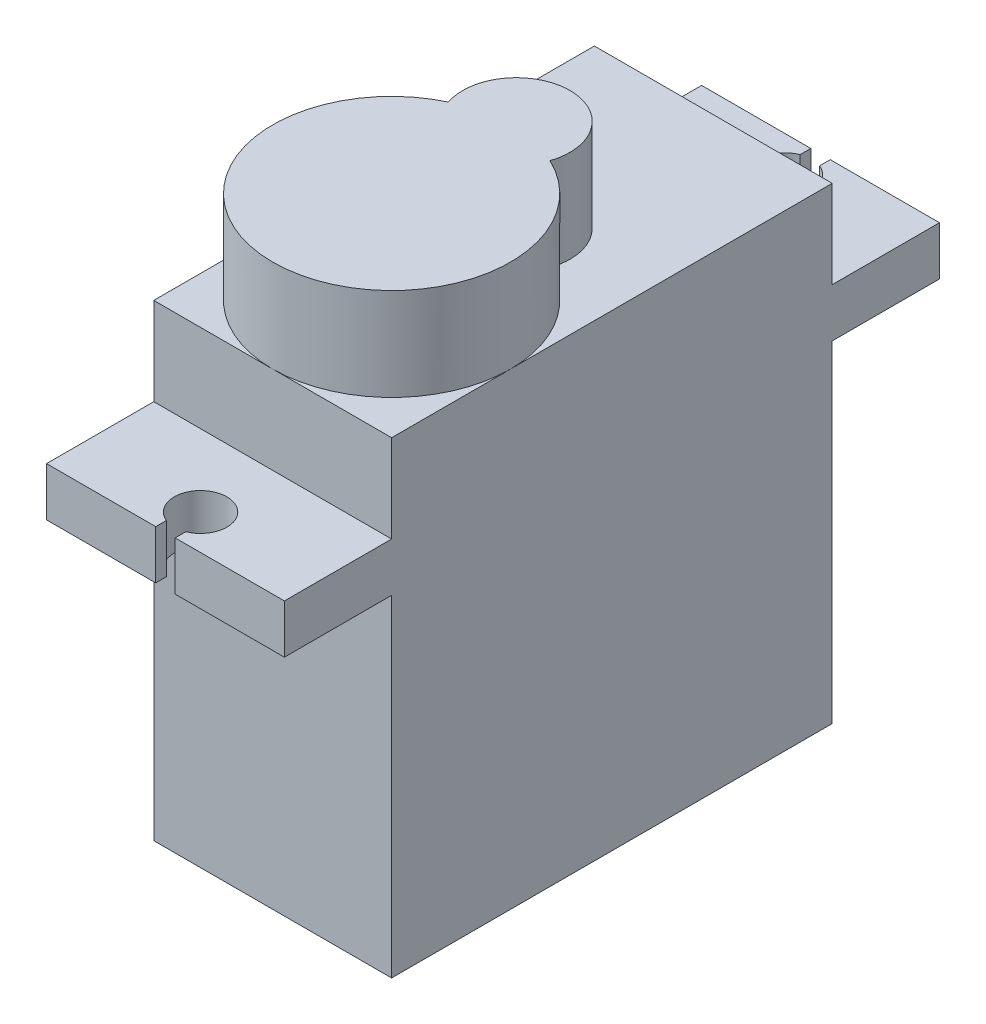
ISO-10303-21;
HEADER;
FILE_DESCRIPTION(('STEP AP214'),'2;1');
FILE_NAME('part.step','',(''),(''),'','','');
FILE_SCHEMA(('AUTOMOTIVE_DESIGN { 1 0 10303 214 1 1 1 1 }'));
ENDSEC;
DATA;
#1=APPLICATION_CONTEXT('core data for automotive mechanical design processes');
#2=APPLICATION_PROTOCOL_DEFINITION('international standard','automotive_design',2000,#1);
#3=PRODUCT_CONTEXT('',#1,'mechanical');
#4=PRODUCT('Part','Part','',(#3));
#5=PRODUCT_RELATED_PRODUCT_CATEGORY('part','',(#4));
#6=PRODUCT_DEFINITION_FORMATION('','',#4);
#7=PRODUCT_DEFINITION_CONTEXT('part definition',#1,'design');
#8=PRODUCT_DEFINITION('design','',#6,#7);
#9=PRODUCT_DEFINITION_SHAPE('','',#8);
#10=(LENGTH_UNIT() NAMED_UNIT(*) SI_UNIT(.MILLI.,.METRE.));
#11=(NAMED_UNIT(*) PLANE_ANGLE_UNIT() SI_UNIT($,.RADIAN.));
#12=(NAMED_UNIT(*) SI_UNIT($,.STERADIAN.) SOLID_ANGLE_UNIT());
#13=UNCERTAINTY_MEASURE_WITH_UNIT(LENGTH_MEASURE(1.E-05),#10,'distance_accuracy_value','');
#14=(GEOMETRIC_REPRESENTATION_CONTEXT(3) GLOBAL_UNCERTAINTY_ASSIGNED_CONTEXT((#13)) GLOBAL_UNIT_ASSIGNED_CONTEXT((#10,
#11,#12)) REPRESENTATION_CONTEXT('',''));
#15=CARTESIAN_POINT('',(0.,0.,0.));
#16=DIRECTION('',(0.,0.,1.));
#17=DIRECTION('',(1.,0.,0.));
#18=AXIS2_PLACEMENT_3D('',#15,#16,#17);
#19=CARTESIAN_POINT('',(0.,24.,0.));
#20=DIRECTION('',(0.,-1.,0.));
#21=DIRECTION('',(0.,0.,-1.));
#22=AXIS2_PLACEMENT_3D('',#19,#20,#21);
#23=PLANE('',#22);
#24=CARTESIAN_POINT('',(6.1,24.,-12.5));
#25=DIRECTION('',(0.,1.,0.));
#26=DIRECTION('',(0.,0.,-1.));
#27=AXIS2_PLACEMENT_3D('',#24,#25,#26);
#28=CIRCLE('',#27,2.75);
#29=CARTESIAN_POINT('',(8.70411537628527,24.,-11.6162109375));
#30=VERTEX_POINT('',#29);
#31=CARTESIAN_POINT('',(3.49588462371473,24.,-11.6162109375));
#32=VERTEX_POINT('',#31);
#33=EDGE_CURVE('E221',#30,#32,#28,.T.);
#34=ORIENTED_EDGE('',*,*,#33,.F.);
#35=CARTESIAN_POINT('',(6.1,24.,-6.1));
#36=DIRECTION('',(0.,1.,0.));
#37=DIRECTION('',(0.,0.,-1.));
#38=AXIS2_PLACEMENT_3D('',#35,#36,#37);
#39=CIRCLE('',#38,6.1);
#40=CARTESIAN_POINT('',(12.2,24.,-6.1));
#41=VERTEX_POINT('',#40);
#42=EDGE_CURVE('E67',#41,#30,#39,.T.);
#43=ORIENTED_EDGE('',*,*,#42,.F.);
#44=DIRECTION('',(0.,0.,-1.));
#45=VECTOR('',#44,1.);
#46=CARTESIAN_POINT('',(12.2,24.,0.));
#47=LINE('',#46,#45);
#48=CARTESIAN_POINT('',(12.2,24.,-22.6));
#49=VERTEX_POINT('',#48);
#50=EDGE_CURVE('E393',#41,#49,#47,.T.);
#51=ORIENTED_EDGE('',*,*,#50,.T.);
#52=DIRECTION('',(-1.,0.,0.));
#53=VECTOR('',#52,1.);
#54=CARTESIAN_POINT('',(0.,24.,-22.6));
#55=LINE('',#54,#53);
#56=CARTESIAN_POINT('',(0.,24.,-22.6));
#57=VERTEX_POINT('',#56);
#58=EDGE_CURVE('E398',#49,#57,#55,.T.);
#59=ORIENTED_EDGE('',*,*,#58,.T.);
#60=DIRECTION('',(0.,0.,1.));
#61=VECTOR('',#60,1.);
#62=CARTESIAN_POINT('',(0.,24.,0.));
#63=LINE('',#62,#61);
#64=CARTESIAN_POINT('',(0.,24.,-6.1));
#65=VERTEX_POINT('',#64);
#66=EDGE_CURVE('E384',#57,#65,#63,.T.);
#67=ORIENTED_EDGE('',*,*,#66,.T.);
#68=EDGE_CURVE('E55',#32,#65,#39,.T.);
#69=ORIENTED_EDGE('',*,*,#68,.F.);
#70=EDGE_LOOP('',(#34,#43,#51,#59,#67,#69));
#71=FACE_BOUND('',#70,.T.);
#72=ADVANCED_FACE('F43',(#71),#23,.F.);
#73=CARTESIAN_POINT('',(6.1,24.,0.));
#74=VERTEX_POINT('',#73);
#75=EDGE_CURVE('E11',#65,#74,#39,.T.);
#76=ORIENTED_EDGE('',*,*,#75,.F.);
#77=CARTESIAN_POINT('',(0.,24.,0.));
#78=VERTEX_POINT('',#77);
#79=EDGE_CURVE('E388',#65,#78,#63,.T.);
#80=ORIENTED_EDGE('',*,*,#79,.T.);
#81=DIRECTION('',(1.,0.,0.));
#82=VECTOR('',#81,1.);
#83=CARTESIAN_POINT('',(0.,24.,0.));
#84=LINE('',#83,#82);
#85=EDGE_CURVE('E389',#78,#74,#84,.T.);
#86=ORIENTED_EDGE('',*,*,#85,.T.);
#87=EDGE_LOOP('',(#76,#80,#86));
#88=FACE_BOUND('',#87,.T.);
#89=ADVANCED_FACE('F460',(#88),#23,.F.);
#90=CARTESIAN_POINT('',(0.,24.,0.));
#91=DIRECTION('',(0.,0.,-1.));
#92=DIRECTION('',(-1.,0.,0.));
#93=AXIS2_PLACEMENT_3D('',#90,#91,#92);
#94=PLANE('',#93);
#95=DIRECTION('',(1.,0.,0.));
#96=VECTOR('',#95,1.);
#97=CARTESIAN_POINT('',(0.,17.,0.));
#98=LINE('',#97,#96);
#99=CARTESIAN_POINT('',(0.,17.,0.));
#100=VERTEX_POINT('',#99);
#101=CARTESIAN_POINT('',(12.2,17.,0.));
#102=VERTEX_POINT('',#101);
#103=EDGE_CURVE('E255',#100,#102,#98,.T.);
#104=ORIENTED_EDGE('',*,*,#103,.F.);
#105=DIRECTION('',(0.,-1.,0.));
#106=VECTOR('',#105,1.);
#107=CARTESIAN_POINT('',(0.,24.,0.));
#108=LINE('',#107,#106);
#109=CARTESIAN_POINT('',(0.,0.,0.));
#110=VERTEX_POINT('',#109);
#111=EDGE_CURVE('E429',#100,#110,#108,.T.);
#112=ORIENTED_EDGE('',*,*,#111,.T.);
#113=DIRECTION('',(1.,0.,0.));
#114=VECTOR('',#113,1.);
#115=CARTESIAN_POINT('',(0.,0.,0.));
#116=LINE('',#115,#114);
#117=CARTESIAN_POINT('',(12.2,0.,0.));
#118=VERTEX_POINT('',#117);
#119=EDGE_CURVE('E405',#110,#118,#116,.T.);
#120=ORIENTED_EDGE('',*,*,#119,.T.);
#121=DIRECTION('',(0.,-1.,0.));
#122=VECTOR('',#121,1.);
#123=CARTESIAN_POINT('',(12.2,24.,0.));
#124=LINE('',#123,#122);
#125=EDGE_CURVE('E425',#102,#118,#124,.T.);
#126=ORIENTED_EDGE('',*,*,#125,.F.);
#127=EDGE_LOOP('',(#104,#112,#120,#126));
#128=FACE_BOUND('',#127,.T.);
#129=ADVANCED_FACE('F444',(#128),#94,.F.);
#130=CARTESIAN_POINT('',(0.,24.,-22.6));
#131=DIRECTION('',(0.,0.,1.));
#132=DIRECTION('',(1.,0.,0.));
#133=AXIS2_PLACEMENT_3D('',#130,#131,#132);
#134=PLANE('',#133);
#135=DIRECTION('',(1.,0.,0.));
#136=VECTOR('',#135,1.);
#137=CARTESIAN_POINT('',(0.,19.5,-22.6));
#138=LINE('',#137,#136);
#139=CARTESIAN_POINT('',(0.,19.5,-22.6));
#140=VERTEX_POINT('',#139);
#141=CARTESIAN_POINT('',(12.2,19.5,-22.6));
#142=VERTEX_POINT('',#141);
#143=EDGE_CURVE('E339',#140,#142,#138,.T.);
#144=ORIENTED_EDGE('',*,*,#143,.F.);
#145=DIRECTION('',(0.,-1.,0.));
#146=VECTOR('',#145,1.);
#147=CARTESIAN_POINT('',(0.,24.,-22.6));
#148=LINE('',#147,#146);
#149=EDGE_CURVE('E417',#57,#140,#148,.T.);
#150=ORIENTED_EDGE('',*,*,#149,.F.);
#151=ORIENTED_EDGE('',*,*,#58,.F.);
#152=DIRECTION('',(0.,-1.,0.));
#153=VECTOR('',#152,1.);
#154=CARTESIAN_POINT('',(12.2,24.,-22.6));
#155=LINE('',#154,#153);
#156=EDGE_CURVE('E422',#49,#142,#155,.T.);
#157=ORIENTED_EDGE('',*,*,#156,.T.);
#158=EDGE_LOOP('',(#144,#150,#151,#157));
#159=FACE_BOUND('',#158,.T.);
#160=ADVANCED_FACE('F483',(#159),#134,.F.);
#161=CARTESIAN_POINT('',(0.,24.,0.));
#162=DIRECTION('',(1.,0.,0.));
#163=DIRECTION('',(0.,0.,-1.));
#164=AXIS2_PLACEMENT_3D('',#161,#162,#163);
#165=PLANE('',#164);
#166=DIRECTION('',(0.,0.,1.));
#167=VECTOR('',#166,1.);
#168=CARTESIAN_POINT('',(0.,0.,0.));
#169=LINE('',#168,#167);
#170=CARTESIAN_POINT('',(0.,0.,-22.6));
#171=VERTEX_POINT('',#170);
#172=EDGE_CURVE('E369',#171,#110,#169,.T.);
#173=ORIENTED_EDGE('',*,*,#172,.T.);
#174=ORIENTED_EDGE('',*,*,#111,.F.);
#175=DIRECTION('',(0.,0.,-1.));
#176=VECTOR('',#175,1.);
#177=CARTESIAN_POINT('',(0.,17.,0.));
#178=LINE('',#177,#176);
#179=CARTESIAN_POINT('',(0.,17.,5.5));
#180=VERTEX_POINT('',#179);
#181=EDGE_CURVE('E232',#180,#100,#178,.T.);
#182=ORIENTED_EDGE('',*,*,#181,.F.);
#183=DIRECTION('',(0.,1.,0.));
#184=VECTOR('',#183,1.);
#185=CARTESIAN_POINT('',(0.,17.,5.5));
#186=LINE('',#185,#184);
#187=CARTESIAN_POINT('',(0.,19.5,5.5));
#188=VERTEX_POINT('',#187);
#189=EDGE_CURVE('E258',#180,#188,#186,.T.);
#190=ORIENTED_EDGE('',*,*,#189,.T.);
#191=DIRECTION('',(0.,0.,-1.));
#192=VECTOR('',#191,1.);
#193=CARTESIAN_POINT('',(0.,19.5,0.));
#194=LINE('',#193,#192);
#195=CARTESIAN_POINT('',(0.,19.5,0.));
#196=VERTEX_POINT('',#195);
#197=EDGE_CURVE('E223',#188,#196,#194,.T.);
#198=ORIENTED_EDGE('',*,*,#197,.T.);
#199=EDGE_CURVE('E47',#78,#196,#108,.T.);
#200=ORIENTED_EDGE('',*,*,#199,.F.);
#201=ORIENTED_EDGE('',*,*,#79,.F.);
#202=ORIENTED_EDGE('',*,*,#66,.F.);
#203=ORIENTED_EDGE('',*,*,#149,.T.);
#204=DIRECTION('',(0.,0.,1.));
#205=VECTOR('',#204,1.);
#206=CARTESIAN_POINT('',(0.,19.5,-22.6));
#207=LINE('',#206,#205);
#208=CARTESIAN_POINT('',(0.,19.5,-28.1));
#209=VERTEX_POINT('',#208);
#210=EDGE_CURVE('E283',#209,#140,#207,.T.);
#211=ORIENTED_EDGE('',*,*,#210,.F.);
#212=DIRECTION('',(0.,1.,0.));
#213=VECTOR('',#212,1.);
#214=CARTESIAN_POINT('',(0.,17.,-28.1));
#215=LINE('',#214,#213);
#216=CARTESIAN_POINT('',(0.,17.,-28.1));
#217=VERTEX_POINT('',#216);
#218=EDGE_CURVE('E366',#217,#209,#215,.T.);
#219=ORIENTED_EDGE('',*,*,#218,.F.);
#220=DIRECTION('',(0.,0.,1.));
#221=VECTOR('',#220,1.);
#222=CARTESIAN_POINT('',(0.,17.,-22.6));
#223=LINE('',#222,#221);
#224=CARTESIAN_POINT('',(0.,17.,-22.6));
#225=VERTEX_POINT('',#224);
#226=EDGE_CURVE('E303',#217,#225,#223,.T.);
#227=ORIENTED_EDGE('',*,*,#226,.T.);
#228=EDGE_CURVE('E401',#225,#171,#148,.T.);
#229=ORIENTED_EDGE('',*,*,#228,.T.);
#230=EDGE_LOOP('',(#173,#174,#182,#190,#198,#200,#201,#202,#203,#211,#219,#227,#229));
#231=FACE_BOUND('',#230,.T.);
#232=ADVANCED_FACE('F45',(#231),#165,.F.);
#233=ORIENTED_EDGE('',*,*,#199,.T.);
#234=DIRECTION('',(1.,0.,0.));
#235=VECTOR('',#234,1.);
#236=CARTESIAN_POINT('',(0.,19.5,0.));
#237=LINE('',#236,#235);
#238=CARTESIAN_POINT('',(12.2,19.5,0.));
#239=VERTEX_POINT('',#238);
#240=EDGE_CURVE('E237',#196,#239,#237,.T.);
#241=ORIENTED_EDGE('',*,*,#240,.T.);
#242=CARTESIAN_POINT('',(12.2,24.,0.));
#243=VERTEX_POINT('',#242);
#244=EDGE_CURVE('E426',#243,#239,#124,.T.);
#245=ORIENTED_EDGE('',*,*,#244,.F.);
#246=EDGE_CURVE('E387',#74,#243,#84,.T.);
#247=ORIENTED_EDGE('',*,*,#246,.F.);
#248=ORIENTED_EDGE('',*,*,#85,.F.);
#249=EDGE_LOOP('',(#233,#241,#245,#247,#248));
#250=FACE_BOUND('',#249,.T.);
#251=ADVANCED_FACE('F466',(#250),#94,.F.);
#252=CARTESIAN_POINT('',(12.2,24.,0.));
#253=DIRECTION('',(-1.,0.,0.));
#254=DIRECTION('',(0.,0.,1.));
#255=AXIS2_PLACEMENT_3D('',#252,#253,#254);
#256=PLANE('',#255);
#257=DIRECTION('',(0.,0.,-1.));
#258=VECTOR('',#257,1.);
#259=CARTESIAN_POINT('',(12.2,0.,0.));
#260=LINE('',#259,#258);
#261=CARTESIAN_POINT('',(12.2,0.,-22.6));
#262=VERTEX_POINT('',#261);
#263=EDGE_CURVE('E409',#118,#262,#260,.T.);
#264=ORIENTED_EDGE('',*,*,#263,.T.);
#265=CARTESIAN_POINT('',(12.2,17.,-22.6));
#266=VERTEX_POINT('',#265);
#267=EDGE_CURVE('E421',#266,#262,#155,.T.);
#268=ORIENTED_EDGE('',*,*,#267,.F.);
#269=DIRECTION('',(0.,0.,-1.));
#270=VECTOR('',#269,1.);
#271=CARTESIAN_POINT('',(12.2,17.,-22.6));
#272=LINE('',#271,#270);
#273=CARTESIAN_POINT('',(12.2,17.,-28.1));
#274=VERTEX_POINT('',#273);
#275=EDGE_CURVE('E312',#266,#274,#272,.T.);
#276=ORIENTED_EDGE('',*,*,#275,.T.);
#277=DIRECTION('',(0.,1.,0.));
#278=VECTOR('',#277,1.);
#279=CARTESIAN_POINT('',(12.2,17.,-28.1));
#280=LINE('',#279,#278);
#281=CARTESIAN_POINT('',(12.2,19.5,-28.1));
#282=VERTEX_POINT('',#281);
#283=EDGE_CURVE('E336',#274,#282,#280,.T.);
#284=ORIENTED_EDGE('',*,*,#283,.T.);
#285=DIRECTION('',(0.,0.,-1.));
#286=VECTOR('',#285,1.);
#287=CARTESIAN_POINT('',(12.2,19.5,-22.6));
#288=LINE('',#287,#286);
#289=EDGE_CURVE('E343',#142,#282,#288,.T.);
#290=ORIENTED_EDGE('',*,*,#289,.F.);
#291=ORIENTED_EDGE('',*,*,#156,.F.);
#292=ORIENTED_EDGE('',*,*,#50,.F.);
#293=EDGE_CURVE('E394',#243,#41,#47,.T.);
#294=ORIENTED_EDGE('',*,*,#293,.F.);
#295=ORIENTED_EDGE('',*,*,#244,.T.);
#296=DIRECTION('',(0.,0.,1.));
#297=VECTOR('',#296,1.);
#298=CARTESIAN_POINT('',(12.2,19.5,0.));
#299=LINE('',#298,#297);
#300=CARTESIAN_POINT('',(12.2,19.5,5.5));
#301=VERTEX_POINT('',#300);
#302=EDGE_CURVE('E274',#239,#301,#299,.T.);
#303=ORIENTED_EDGE('',*,*,#302,.T.);
#304=DIRECTION('',(0.,1.,0.));
#305=VECTOR('',#304,1.);
#306=CARTESIAN_POINT('',(12.2,17.,5.5));
#307=LINE('',#306,#305);
#308=CARTESIAN_POINT('',(12.2,17.,5.5));
#309=VERTEX_POINT('',#308);
#310=EDGE_CURVE('E279',#309,#301,#307,.T.);
#311=ORIENTED_EDGE('',*,*,#310,.F.);
#312=DIRECTION('',(0.,0.,1.));
#313=VECTOR('',#312,1.);
#314=CARTESIAN_POINT('',(12.2,17.,0.));
#315=LINE('',#314,#313);
#316=EDGE_CURVE('E252',#102,#309,#315,.T.);
#317=ORIENTED_EDGE('',*,*,#316,.F.);
#318=ORIENTED_EDGE('',*,*,#125,.T.);
#319=EDGE_LOOP('',(#264,#268,#276,#284,#290,#291,#292,#294,#295,#303,#311,#317,#318));
#320=FACE_BOUND('',#319,.T.);
#321=ADVANCED_FACE('F437',(#320),#256,.F.);
#322=ORIENTED_EDGE('',*,*,#228,.F.);
#323=DIRECTION('',(1.,0.,0.));
#324=VECTOR('',#323,1.);
#325=CARTESIAN_POINT('',(0.,17.,-22.6));
#326=LINE('',#325,#324);
#327=EDGE_CURVE('E307',#225,#266,#326,.T.);
#328=ORIENTED_EDGE('',*,*,#327,.T.);
#329=ORIENTED_EDGE('',*,*,#267,.T.);
#330=DIRECTION('',(-1.,0.,0.));
#331=VECTOR('',#330,1.);
#332=CARTESIAN_POINT('',(0.,0.,-22.6));
#333=LINE('',#332,#331);
#334=EDGE_CURVE('E413',#262,#171,#333,.T.);
#335=ORIENTED_EDGE('',*,*,#334,.T.);
#336=EDGE_LOOP('',(#322,#328,#329,#335));
#337=FACE_BOUND('',#336,.T.);
#338=ADVANCED_FACE('F451',(#337),#134,.F.);
#339=EDGE_CURVE('E53',#74,#41,#39,.T.);
#340=ORIENTED_EDGE('',*,*,#339,.F.);
#341=ORIENTED_EDGE('',*,*,#246,.T.);
#342=ORIENTED_EDGE('',*,*,#293,.T.);
#343=EDGE_LOOP('',(#340,#341,#342));
#344=FACE_BOUND('',#343,.T.);
#345=ADVANCED_FACE('F477',(#344),#23,.F.);
#346=CARTESIAN_POINT('',(0.,0.,0.));
#347=DIRECTION('',(0.,-1.,0.));
#348=DIRECTION('',(0.,0.,-1.));
#349=AXIS2_PLACEMENT_3D('',#346,#347,#348);
#350=PLANE('',#349);
#351=ORIENTED_EDGE('',*,*,#172,.F.);
#352=ORIENTED_EDGE('',*,*,#334,.F.);
#353=ORIENTED_EDGE('',*,*,#263,.F.);
#354=ORIENTED_EDGE('',*,*,#119,.F.);
#355=EDGE_LOOP('',(#351,#352,#353,#354));
#356=FACE_BOUND('',#355,.T.);
#357=ADVANCED_FACE('F448',(#356),#350,.T.);
#358=CARTESIAN_POINT('',(0.,17.,-28.1));
#359=DIRECTION('',(0.,0.,-1.));
#360=DIRECTION('',(-1.,0.,0.));
#361=AXIS2_PLACEMENT_3D('',#358,#359,#360);
#362=PLANE('',#361);
#363=DIRECTION('',(-1.,0.,0.));
#364=VECTOR('',#363,1.);
#365=CARTESIAN_POINT('',(0.,19.5,-28.1));
#366=LINE('',#365,#364);
#367=CARTESIAN_POINT('',(5.6,19.5,-28.1));
#368=VERTEX_POINT('',#367);
#369=EDGE_CURVE('E308',#368,#209,#366,.T.);
#370=ORIENTED_EDGE('',*,*,#369,.F.);
#371=DIRECTION('',(0.,1.,0.));
#372=VECTOR('',#371,1.);
#373=CARTESIAN_POINT('',(5.6,17.,-28.1));
#374=LINE('',#373,#372);
#375=CARTESIAN_POINT('',(5.6,17.,-28.1));
#376=VERTEX_POINT('',#375);
#377=EDGE_CURVE('E370',#376,#368,#374,.T.);
#378=ORIENTED_EDGE('',*,*,#377,.F.);
#379=DIRECTION('',(-1.,0.,0.));
#380=VECTOR('',#379,1.);
#381=CARTESIAN_POINT('',(0.,17.,-28.1));
#382=LINE('',#381,#380);
#383=EDGE_CURVE('E332',#376,#217,#382,.T.);
#384=ORIENTED_EDGE('',*,*,#383,.T.);
#385=ORIENTED_EDGE('',*,*,#218,.T.);
#386=EDGE_LOOP('',(#370,#378,#384,#385));
#387=FACE_BOUND('',#386,.T.);
#388=ADVANCED_FACE('F491',(#387),#362,.T.);
#389=CARTESIAN_POINT('',(5.6,17.,-27.5539936203984));
#390=DIRECTION('',(1.,0.,0.));
#391=DIRECTION('',(0.,0.,-1.));
#392=AXIS2_PLACEMENT_3D('',#389,#390,#391);
#393=PLANE('',#392);
#394=DIRECTION('',(0.,0.,-1.));
#395=VECTOR('',#394,1.);
#396=CARTESIAN_POINT('',(5.6,19.5,-27.5539936203984));
#397=LINE('',#396,#395);
#398=CARTESIAN_POINT('',(5.6,19.5,-27.5539936203984));
#399=VERTEX_POINT('',#398);
#400=EDGE_CURVE('E359',#399,#368,#397,.T.);
#401=ORIENTED_EDGE('',*,*,#400,.F.);
#402=DIRECTION('',(0.,1.,0.));
#403=VECTOR('',#402,1.);
#404=CARTESIAN_POINT('',(5.6,17.,-27.5539936203984));
#405=LINE('',#404,#403);
#406=CARTESIAN_POINT('',(5.6,17.,-27.5539936203984));
#407=VERTEX_POINT('',#406);
#408=EDGE_CURVE('E373',#407,#399,#405,.T.);
#409=ORIENTED_EDGE('',*,*,#408,.F.);
#410=DIRECTION('',(0.,0.,-1.));
#411=VECTOR('',#410,1.);
#412=CARTESIAN_POINT('',(5.6,17.,-27.5539936203984));
#413=LINE('',#412,#411);
#414=EDGE_CURVE('E328',#407,#376,#413,.T.);
#415=ORIENTED_EDGE('',*,*,#414,.T.);
#416=ORIENTED_EDGE('',*,*,#377,.T.);
#417=EDGE_LOOP('',(#401,#409,#415,#416));
#418=FACE_BOUND('',#417,.T.);
#419=ADVANCED_FACE('F719',(#418),#393,.T.);
#420=CARTESIAN_POINT('',(6.1,17.,-26.3));
#421=DIRECTION('',(0.,1.,0.));
#422=DIRECTION('',(0.,0.,1.));
#423=AXIS2_PLACEMENT_3D('',#420,#421,#422);
#424=CYLINDRICAL_SURFACE('',#423,1.35);
#425=CARTESIAN_POINT('',(6.1,19.5,-26.3));
#426=DIRECTION('',(0.,-1.,0.));
#427=DIRECTION('',(0.,0.,1.));
#428=AXIS2_PLACEMENT_3D('',#425,#426,#427);
#429=CIRCLE('',#428,1.35);
#430=CARTESIAN_POINT('',(6.6,19.5,-27.5539936203984));
#431=VERTEX_POINT('',#430);
#432=EDGE_CURVE('E355',#431,#399,#429,.T.);
#433=ORIENTED_EDGE('',*,*,#432,.F.);
#434=DIRECTION('',(0.,1.,0.));
#435=VECTOR('',#434,1.);
#436=CARTESIAN_POINT('',(6.6,17.,-27.5539936203984));
#437=LINE('',#436,#435);
#438=CARTESIAN_POINT('',(6.6,17.,-27.5539936203984));
#439=VERTEX_POINT('',#438);
#440=EDGE_CURVE('E376',#439,#431,#437,.T.);
#441=ORIENTED_EDGE('',*,*,#440,.F.);
#442=CARTESIAN_POINT('',(6.1,17.,-26.3));
#443=DIRECTION('',(0.,-1.,0.));
#444=DIRECTION('',(0.,0.,1.));
#445=AXIS2_PLACEMENT_3D('',#442,#443,#444);
#446=CIRCLE('',#445,1.35);
#447=EDGE_CURVE('E324',#439,#407,#446,.T.);
#448=ORIENTED_EDGE('',*,*,#447,.T.);
#449=ORIENTED_EDGE('',*,*,#408,.T.);
#450=EDGE_LOOP('',(#433,#441,#448,#449));
#451=FACE_BOUND('',#450,.T.);
#452=ADVANCED_FACE('F709',(#451),#424,.F.);
#453=CARTESIAN_POINT('',(6.6,17.,-27.5539936203984));
#454=DIRECTION('',(-1.,0.,0.));
#455=DIRECTION('',(0.,0.,1.));
#456=AXIS2_PLACEMENT_3D('',#453,#454,#455);
#457=PLANE('',#456);
#458=DIRECTION('',(0.,0.,1.));
#459=VECTOR('',#458,1.);
#460=CARTESIAN_POINT('',(6.6,19.5,-27.5539936203984));
#461=LINE('',#460,#459);
#462=CARTESIAN_POINT('',(6.6,19.5,-28.1));
#463=VERTEX_POINT('',#462);
#464=EDGE_CURVE('E351',#463,#431,#461,.T.);
#465=ORIENTED_EDGE('',*,*,#464,.F.);
#466=DIRECTION('',(0.,1.,0.));
#467=VECTOR('',#466,1.);
#468=CARTESIAN_POINT('',(6.6,17.,-28.1));
#469=LINE('',#468,#467);
#470=CARTESIAN_POINT('',(6.6,17.,-28.1));
#471=VERTEX_POINT('',#470);
#472=EDGE_CURVE('E379',#471,#463,#469,.T.);
#473=ORIENTED_EDGE('',*,*,#472,.F.);
#474=DIRECTION('',(0.,0.,1.));
#475=VECTOR('',#474,1.);
#476=CARTESIAN_POINT('',(6.6,17.,-27.5539936203984));
#477=LINE('',#476,#475);
#478=EDGE_CURVE('E320',#471,#439,#477,.T.);
#479=ORIENTED_EDGE('',*,*,#478,.T.);
#480=ORIENTED_EDGE('',*,*,#440,.T.);
#481=EDGE_LOOP('',(#465,#473,#479,#480));
#482=FACE_BOUND('',#481,.T.);
#483=ADVANCED_FACE('F700',(#482),#457,.T.);
#484=CARTESIAN_POINT('',(6.6,17.,-28.1));
#485=DIRECTION('',(0.,0.,-1.));
#486=DIRECTION('',(-1.,0.,0.));
#487=AXIS2_PLACEMENT_3D('',#484,#485,#486);
#488=PLANE('',#487);
#489=DIRECTION('',(-1.,0.,0.));
#490=VECTOR('',#489,1.);
#491=CARTESIAN_POINT('',(6.6,19.5,-28.1));
#492=LINE('',#491,#490);
#493=EDGE_CURVE('E347',#282,#463,#492,.T.);
#494=ORIENTED_EDGE('',*,*,#493,.F.);
#495=ORIENTED_EDGE('',*,*,#283,.F.);
#496=DIRECTION('',(-1.,0.,0.));
#497=VECTOR('',#496,1.);
#498=CARTESIAN_POINT('',(6.6,17.,-28.1));
#499=LINE('',#498,#497);
#500=EDGE_CURVE('E316',#274,#471,#499,.T.);
#501=ORIENTED_EDGE('',*,*,#500,.T.);
#502=ORIENTED_EDGE('',*,*,#472,.T.);
#503=EDGE_LOOP('',(#494,#495,#501,#502));
#504=FACE_BOUND('',#503,.T.);
#505=ADVANCED_FACE('F691',(#504),#488,.T.);
#506=CARTESIAN_POINT('',(6.1,17.,-26.3));
#507=DIRECTION('',(0.,1.,0.));
#508=DIRECTION('',(0.,0.,1.));
#509=AXIS2_PLACEMENT_3D('',#506,#507,#508);
#510=PLANE('',#509);
#511=ORIENTED_EDGE('',*,*,#226,.F.);
#512=ORIENTED_EDGE('',*,*,#383,.F.);
#513=ORIENTED_EDGE('',*,*,#414,.F.);
#514=ORIENTED_EDGE('',*,*,#447,.F.);
#515=ORIENTED_EDGE('',*,*,#478,.F.);
#516=ORIENTED_EDGE('',*,*,#500,.F.);
#517=ORIENTED_EDGE('',*,*,#275,.F.);
#518=ORIENTED_EDGE('',*,*,#327,.F.);
#519=EDGE_LOOP('',(#511,#512,#513,#514,#515,#516,#517,#518));
#520=FACE_BOUND('',#519,.T.);
#521=ADVANCED_FACE('F495',(#520),#510,.F.);
#522=CARTESIAN_POINT('',(6.1,19.5,-26.3));
#523=DIRECTION('',(0.,1.,0.));
#524=DIRECTION('',(0.,0.,1.));
#525=AXIS2_PLACEMENT_3D('',#522,#523,#524);
#526=PLANE('',#525);
#527=ORIENTED_EDGE('',*,*,#210,.T.);
#528=ORIENTED_EDGE('',*,*,#143,.T.);
#529=ORIENTED_EDGE('',*,*,#289,.T.);
#530=ORIENTED_EDGE('',*,*,#493,.T.);
#531=ORIENTED_EDGE('',*,*,#464,.T.);
#532=ORIENTED_EDGE('',*,*,#432,.T.);
#533=ORIENTED_EDGE('',*,*,#400,.T.);
#534=ORIENTED_EDGE('',*,*,#369,.T.);
#535=EDGE_LOOP('',(#527,#528,#529,#530,#531,#532,#533,#534));
#536=FACE_BOUND('',#535,.T.);
#537=ADVANCED_FACE('F488',(#536),#526,.T.);
#538=CARTESIAN_POINT('',(6.6,17.,5.5));
#539=DIRECTION('',(0.,0.,-1.));
#540=DIRECTION('',(-1.,0.,0.));
#541=AXIS2_PLACEMENT_3D('',#538,#539,#540);
#542=PLANE('',#541);
#543=DIRECTION('',(-1.,0.,0.));
#544=VECTOR('',#543,1.);
#545=CARTESIAN_POINT('',(6.6,19.5,5.5));
#546=LINE('',#545,#544);
#547=CARTESIAN_POINT('',(6.6,19.5,5.5));
#548=VERTEX_POINT('',#547);
#549=EDGE_CURVE('E271',#301,#548,#546,.T.);
#550=ORIENTED_EDGE('',*,*,#549,.T.);
#551=DIRECTION('',(0.,1.,0.));
#552=VECTOR('',#551,1.);
#553=CARTESIAN_POINT('',(6.6,17.,5.5));
#554=LINE('',#553,#552);
#555=CARTESIAN_POINT('',(6.6,17.,5.5));
#556=VERTEX_POINT('',#555);
#557=EDGE_CURVE('E284',#556,#548,#554,.T.);
#558=ORIENTED_EDGE('',*,*,#557,.F.);
#559=DIRECTION('',(-1.,0.,0.));
#560=VECTOR('',#559,1.);
#561=CARTESIAN_POINT('',(6.6,17.,5.5));
#562=LINE('',#561,#560);
#563=EDGE_CURVE('E249',#309,#556,#562,.T.);
#564=ORIENTED_EDGE('',*,*,#563,.F.);
#565=ORIENTED_EDGE('',*,*,#310,.T.);
#566=EDGE_LOOP('',(#550,#558,#564,#565));
#567=FACE_BOUND('',#566,.T.);
#568=ADVANCED_FACE('F514',(#567),#542,.F.);
#569=CARTESIAN_POINT('',(6.6,17.,4.95399362039844));
#570=DIRECTION('',(1.,0.,0.));
#571=DIRECTION('',(0.,0.,-1.));
#572=AXIS2_PLACEMENT_3D('',#569,#570,#571);
#573=PLANE('',#572);
#574=DIRECTION('',(0.,0.,-1.));
#575=VECTOR('',#574,1.);
#576=CARTESIAN_POINT('',(6.6,19.5,4.95399362039844));
#577=LINE('',#576,#575);
#578=CARTESIAN_POINT('',(6.6,19.5,4.95399362039844));
#579=VERTEX_POINT('',#578);
#580=EDGE_CURVE('E268',#548,#579,#577,.T.);
#581=ORIENTED_EDGE('',*,*,#580,.T.);
#582=DIRECTION('',(0.,1.,0.));
#583=VECTOR('',#582,1.);
#584=CARTESIAN_POINT('',(6.6,17.,4.95399362039844));
#585=LINE('',#584,#583);
#586=CARTESIAN_POINT('',(6.6,17.,4.95399362039844));
#587=VERTEX_POINT('',#586);
#588=EDGE_CURVE('E288',#587,#579,#585,.T.);
#589=ORIENTED_EDGE('',*,*,#588,.F.);
#590=DIRECTION('',(0.,0.,-1.));
#591=VECTOR('',#590,1.);
#592=CARTESIAN_POINT('',(6.6,17.,4.95399362039844));
#593=LINE('',#592,#591);
#594=EDGE_CURVE('E246',#556,#587,#593,.T.);
#595=ORIENTED_EDGE('',*,*,#594,.F.);
#596=ORIENTED_EDGE('',*,*,#557,.T.);
#597=EDGE_LOOP('',(#581,#589,#595,#596));
#598=FACE_BOUND('',#597,.T.);
#599=ADVANCED_FACE('F521',(#598),#573,.F.);
#600=CARTESIAN_POINT('',(6.1,17.,3.7));
#601=DIRECTION('',(0.,1.,0.));
#602=DIRECTION('',(0.,0.,1.));
#603=AXIS2_PLACEMENT_3D('',#600,#601,#602);
#604=CYLINDRICAL_SURFACE('',#603,1.35);
#605=CARTESIAN_POINT('',(6.1,19.5,3.7));
#606=DIRECTION('',(0.,1.,0.));
#607=DIRECTION('',(0.,0.,-1.));
#608=AXIS2_PLACEMENT_3D('',#605,#606,#607);
#609=CIRCLE('',#608,1.35);
#610=CARTESIAN_POINT('',(5.6,19.5,4.95399362039844));
#611=VERTEX_POINT('',#610);
#612=EDGE_CURVE('E265',#579,#611,#609,.T.);
#613=ORIENTED_EDGE('',*,*,#612,.T.);
#614=DIRECTION('',(0.,1.,0.));
#615=VECTOR('',#614,1.);
#616=CARTESIAN_POINT('',(5.6,17.,4.95399362039844));
#617=LINE('',#616,#615);
#618=CARTESIAN_POINT('',(5.6,17.,4.95399362039844));
#619=VERTEX_POINT('',#618);
#620=EDGE_CURVE('E292',#619,#611,#617,.T.);
#621=ORIENTED_EDGE('',*,*,#620,.F.);
#622=CARTESIAN_POINT('',(6.1,17.,3.7));
#623=DIRECTION('',(0.,1.,0.));
#624=DIRECTION('',(0.,0.,-1.));
#625=AXIS2_PLACEMENT_3D('',#622,#623,#624);
#626=CIRCLE('',#625,1.35);
#627=EDGE_CURVE('E243',#587,#619,#626,.T.);
#628=ORIENTED_EDGE('',*,*,#627,.F.);
#629=ORIENTED_EDGE('',*,*,#588,.T.);
#630=EDGE_LOOP('',(#613,#621,#628,#629));
#631=FACE_BOUND('',#630,.T.);
#632=ADVANCED_FACE('F524',(#631),#604,.F.);
#633=CARTESIAN_POINT('',(5.6,17.,4.95399362039844));
#634=DIRECTION('',(-1.,0.,0.));
#635=DIRECTION('',(0.,0.,1.));
#636=AXIS2_PLACEMENT_3D('',#633,#634,#635);
#637=PLANE('',#636);
#638=DIRECTION('',(0.,0.,1.));
#639=VECTOR('',#638,1.);
#640=CARTESIAN_POINT('',(5.6,19.5,4.95399362039844));
#641=LINE('',#640,#639);
#642=CARTESIAN_POINT('',(5.6,19.5,5.5));
#643=VERTEX_POINT('',#642);
#644=EDGE_CURVE('E262',#611,#643,#641,.T.);
#645=ORIENTED_EDGE('',*,*,#644,.T.);
#646=DIRECTION('',(0.,1.,0.));
#647=VECTOR('',#646,1.);
#648=CARTESIAN_POINT('',(5.6,17.,5.5));
#649=LINE('',#648,#647);
#650=CARTESIAN_POINT('',(5.6,17.,5.5));
#651=VERTEX_POINT('',#650);
#652=EDGE_CURVE('E296',#651,#643,#649,.T.);
#653=ORIENTED_EDGE('',*,*,#652,.F.);
#654=DIRECTION('',(0.,0.,1.));
#655=VECTOR('',#654,1.);
#656=CARTESIAN_POINT('',(5.6,17.,4.95399362039844));
#657=LINE('',#656,#655);
#658=EDGE_CURVE('E240',#619,#651,#657,.T.);
#659=ORIENTED_EDGE('',*,*,#658,.F.);
#660=ORIENTED_EDGE('',*,*,#620,.T.);
#661=EDGE_LOOP('',(#645,#653,#659,#660));
#662=FACE_BOUND('',#661,.T.);
#663=ADVANCED_FACE('F526',(#662),#637,.F.);
#664=CARTESIAN_POINT('',(0.,17.,5.5));
#665=DIRECTION('',(0.,0.,-1.));
#666=DIRECTION('',(-1.,0.,0.));
#667=AXIS2_PLACEMENT_3D('',#664,#665,#666);
#668=PLANE('',#667);
#669=DIRECTION('',(-1.,0.,0.));
#670=VECTOR('',#669,1.);
#671=CARTESIAN_POINT('',(0.,19.5,5.5));
#672=LINE('',#671,#670);
#673=EDGE_CURVE('E228',#643,#188,#672,.T.);
#674=ORIENTED_EDGE('',*,*,#673,.T.);
#675=ORIENTED_EDGE('',*,*,#189,.F.);
#676=DIRECTION('',(-1.,0.,0.));
#677=VECTOR('',#676,1.);
#678=CARTESIAN_POINT('',(0.,17.,5.5));
#679=LINE('',#678,#677);
#680=EDGE_CURVE('E236',#651,#180,#679,.T.);
#681=ORIENTED_EDGE('',*,*,#680,.F.);
#682=ORIENTED_EDGE('',*,*,#652,.T.);
#683=EDGE_LOOP('',(#674,#675,#681,#682));
#684=FACE_BOUND('',#683,.T.);
#685=ADVANCED_FACE('F505',(#684),#668,.F.);
#686=CARTESIAN_POINT('',(6.1,17.,3.7));
#687=DIRECTION('',(0.,1.,0.));
#688=DIRECTION('',(0.,0.,-1.));
#689=AXIS2_PLACEMENT_3D('',#686,#687,#688);
#690=PLANE('',#689);
#691=ORIENTED_EDGE('',*,*,#181,.T.);
#692=ORIENTED_EDGE('',*,*,#103,.T.);
#693=ORIENTED_EDGE('',*,*,#316,.T.);
#694=ORIENTED_EDGE('',*,*,#563,.T.);
#695=ORIENTED_EDGE('',*,*,#594,.T.);
#696=ORIENTED_EDGE('',*,*,#627,.T.);
#697=ORIENTED_EDGE('',*,*,#658,.T.);
#698=ORIENTED_EDGE('',*,*,#680,.T.);
#699=EDGE_LOOP('',(#691,#692,#693,#694,#695,#696,#697,#698));
#700=FACE_BOUND('',#699,.T.);
#701=ADVANCED_FACE('F499',(#700),#690,.F.);
#702=CARTESIAN_POINT('',(6.1,19.5,3.7));
#703=DIRECTION('',(0.,1.,0.));
#704=DIRECTION('',(0.,0.,-1.));
#705=AXIS2_PLACEMENT_3D('',#702,#703,#704);
#706=PLANE('',#705);
#707=ORIENTED_EDGE('',*,*,#197,.F.);
#708=ORIENTED_EDGE('',*,*,#673,.F.);
#709=ORIENTED_EDGE('',*,*,#644,.F.);
#710=ORIENTED_EDGE('',*,*,#612,.F.);
#711=ORIENTED_EDGE('',*,*,#580,.F.);
#712=ORIENTED_EDGE('',*,*,#549,.F.);
#713=ORIENTED_EDGE('',*,*,#302,.F.);
#714=ORIENTED_EDGE('',*,*,#240,.F.);
#715=EDGE_LOOP('',(#707,#708,#709,#710,#711,#712,#713,#714));
#716=FACE_BOUND('',#715,.T.);
#717=ADVANCED_FACE('F508',(#716),#706,.T.);
#718=CARTESIAN_POINT('',(6.1,28.75,-12.5));
#719=DIRECTION('',(0.,-1.,0.));
#720=DIRECTION('',(0.,0.,-1.));
#721=AXIS2_PLACEMENT_3D('',#718,#719,#720);
#722=CYLINDRICAL_SURFACE('',#721,2.75);
#723=ORIENTED_EDGE('',*,*,#33,.T.);
#724=DIRECTION('',(0.,-1.,0.));
#725=VECTOR('',#724,1.);
#726=CARTESIAN_POINT('',(3.49588462371473,28.75,-11.6162109375));
#727=LINE('',#726,#725);
#728=CARTESIAN_POINT('',(3.49588462371473,28.75,-11.6162109375));
#729=VERTEX_POINT('',#728);
#730=EDGE_CURVE('E207',#729,#32,#727,.T.);
#731=ORIENTED_EDGE('',*,*,#730,.F.);
#732=CARTESIAN_POINT('',(6.1,28.75,-12.5));
#733=DIRECTION('',(0.,1.,0.));
#734=DIRECTION('',(0.,0.,-1.));
#735=AXIS2_PLACEMENT_3D('',#732,#733,#734);
#736=CIRCLE('',#735,2.75);
#737=CARTESIAN_POINT('',(8.70411537628527,28.75,-11.6162109375));
#738=VERTEX_POINT('',#737);
#739=EDGE_CURVE('E214',#738,#729,#736,.T.);
#740=ORIENTED_EDGE('',*,*,#739,.F.);
#741=DIRECTION('',(0.,-1.,0.));
#742=VECTOR('',#741,1.);
#743=CARTESIAN_POINT('',(8.70411537628527,28.75,-11.6162109375));
#744=LINE('',#743,#742);
#745=EDGE_CURVE('E210',#738,#30,#744,.T.);
#746=ORIENTED_EDGE('',*,*,#745,.T.);
#747=EDGE_LOOP('',(#723,#731,#740,#746));
#748=FACE_BOUND('',#747,.T.);
#749=ADVANCED_FACE('F220',(#748),#722,.T.);
#750=CARTESIAN_POINT('',(6.1,28.75,-6.1));
#751=DIRECTION('',(0.,-1.,0.));
#752=DIRECTION('',(0.,0.,-1.));
#753=AXIS2_PLACEMENT_3D('',#750,#751,#752);
#754=CYLINDRICAL_SURFACE('',#753,6.1);
#755=ORIENTED_EDGE('',*,*,#68,.T.);
#756=ORIENTED_EDGE('',*,*,#75,.T.);
#757=ORIENTED_EDGE('',*,*,#339,.T.);
#758=ORIENTED_EDGE('',*,*,#42,.T.);
#759=ORIENTED_EDGE('',*,*,#745,.F.);
#760=CARTESIAN_POINT('',(6.1,28.75,-6.1));
#761=DIRECTION('',(0.,1.,0.));
#762=DIRECTION('',(0.,0.,-1.));
#763=AXIS2_PLACEMENT_3D('',#760,#761,#762);
#764=CIRCLE('',#763,6.1);
#765=EDGE_CURVE('E203',#729,#738,#764,.T.);
#766=ORIENTED_EDGE('',*,*,#765,.F.);
#767=ORIENTED_EDGE('',*,*,#730,.T.);
#768=EDGE_LOOP('',(#755,#756,#757,#758,#759,#766,#767));
#769=FACE_BOUND('',#768,.T.);
#770=ADVANCED_FACE('F205',(#769),#754,.T.);
#771=CARTESIAN_POINT('',(6.1,28.75,-9.3));
#772=DIRECTION('',(0.,-1.,0.));
#773=DIRECTION('',(0.,0.,-1.));
#774=AXIS2_PLACEMENT_3D('',#771,#772,#773);
#775=PLANE('',#774);
#776=ORIENTED_EDGE('',*,*,#739,.T.);
#777=ORIENTED_EDGE('',*,*,#765,.T.);
#778=EDGE_LOOP('',(#776,#777));
#779=FACE_BOUND('',#778,.T.);
#780=ADVANCED_FACE('F216',(#779),#775,.F.);
#781=CLOSED_SHELL('',(#72,#89,#129,#160,#232,#251,#321,#338,#345,#357,#388,#419,#452,#483,#505,
#521,#537,#568,#599,#632,#663,#685,#701,#717,#749,#770,#780));
#782=MANIFOLD_SOLID_BREP('B2',#781);
#783=ADVANCED_BREP_SHAPE_REPRESENTATION('',(#18,#782),#14);
#784=SHAPE_DEFINITION_REPRESENTATION(#9,#783);
ENDSEC;
END-ISO-10303-21;
